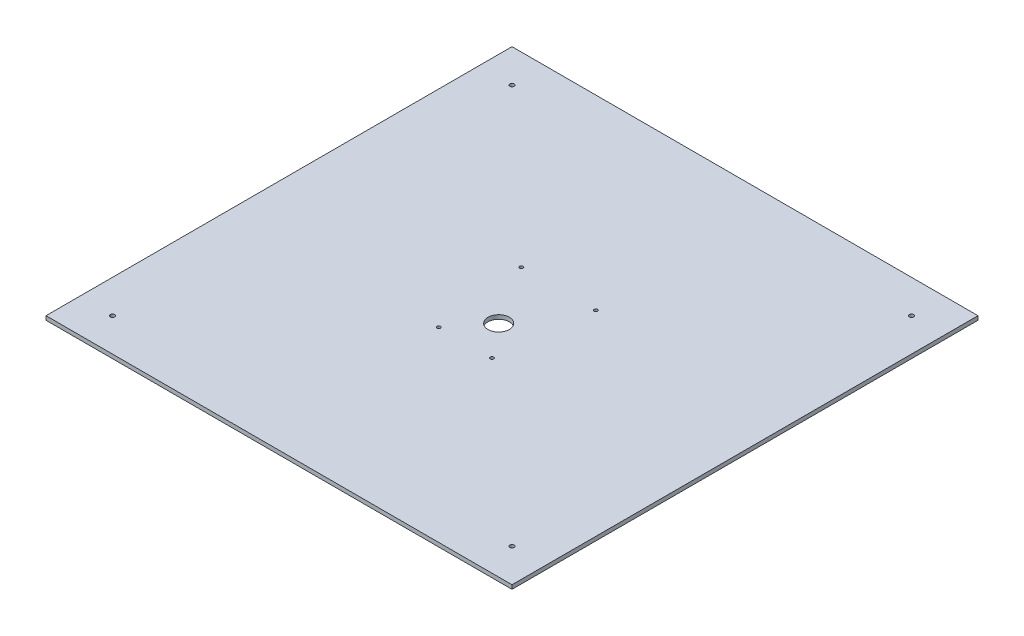
ISO-10303-21;
HEADER;
FILE_DESCRIPTION(('STEP AP214'),'2;1');
FILE_NAME('part.step','',(''),(''),'','','');
FILE_SCHEMA(('AUTOMOTIVE_DESIGN { 1 0 10303 214 1 1 1 1 }'));
ENDSEC;
DATA;
#1=APPLICATION_CONTEXT('core data for automotive mechanical design processes');
#2=APPLICATION_PROTOCOL_DEFINITION('international standard','automotive_design',2000,#1);
#3=PRODUCT_CONTEXT('',#1,'mechanical');
#4=PRODUCT('Part','Part','',(#3));
#5=PRODUCT_RELATED_PRODUCT_CATEGORY('part','',(#4));
#6=PRODUCT_DEFINITION_FORMATION('','',#4);
#7=PRODUCT_DEFINITION_CONTEXT('part definition',#1,'design');
#8=PRODUCT_DEFINITION('design','',#6,#7);
#9=PRODUCT_DEFINITION_SHAPE('','',#8);
#10=(LENGTH_UNIT() NAMED_UNIT(*) SI_UNIT(.MILLI.,.METRE.));
#11=(NAMED_UNIT(*) PLANE_ANGLE_UNIT() SI_UNIT($,.RADIAN.));
#12=(NAMED_UNIT(*) SI_UNIT($,.STERADIAN.) SOLID_ANGLE_UNIT());
#13=UNCERTAINTY_MEASURE_WITH_UNIT(LENGTH_MEASURE(1.E-05),#10,'distance_accuracy_value','');
#14=(GEOMETRIC_REPRESENTATION_CONTEXT(3) GLOBAL_UNCERTAINTY_ASSIGNED_CONTEXT((#13)) GLOBAL_UNIT_ASSIGNED_CONTEXT((#10,
#11,#12)) REPRESENTATION_CONTEXT('',''));
#15=CARTESIAN_POINT('',(0.,0.,0.));
#16=DIRECTION('',(0.,0.,1.));
#17=DIRECTION('',(1.,0.,0.));
#18=AXIS2_PLACEMENT_3D('',#15,#16,#17);
#19=CARTESIAN_POINT('',(0.,3.,0.));
#20=DIRECTION('',(0.,-1.,0.));
#21=DIRECTION('',(0.,0.,-1.));
#22=AXIS2_PLACEMENT_3D('',#19,#20,#21);
#23=PLANE('',#22);
#24=CARTESIAN_POINT('',(20.,3.,35.));
#25=DIRECTION('',(0.,1.,0.));
#26=DIRECTION('',(0.,0.,1.));
#27=AXIS2_PLACEMENT_3D('',#24,#25,#26);
#28=CIRCLE('',#27,1.3);
#29=CARTESIAN_POINT('',(20.,3.,36.3));
#30=VERTEX_POINT('',#29);
#31=EDGE_CURVE('E324',#30,#30,#28,.T.);
#32=ORIENTED_EDGE('',*,*,#31,.F.);
#33=EDGE_LOOP('',(#32));
#34=FACE_BOUND('',#33,.T.);
#35=CARTESIAN_POINT('',(-20.,3.,35.));
#36=DIRECTION('',(0.,1.,0.));
#37=DIRECTION('',(0.,0.,1.));
#38=AXIS2_PLACEMENT_3D('',#35,#36,#37);
#39=CIRCLE('',#38,1.3);
#40=CARTESIAN_POINT('',(-20.,3.,36.3));
#41=VERTEX_POINT('',#40);
#42=EDGE_CURVE('E327',#41,#41,#39,.T.);
#43=ORIENTED_EDGE('',*,*,#42,.F.);
#44=EDGE_LOOP('',(#43));
#45=FACE_BOUND('',#44,.T.);
#46=CARTESIAN_POINT('',(28.,3.,-35.));
#47=DIRECTION('',(0.,1.,0.));
#48=DIRECTION('',(0.,0.,1.));
#49=AXIS2_PLACEMENT_3D('',#46,#47,#48);
#50=CIRCLE('',#49,1.3);
#51=CARTESIAN_POINT('',(28.,3.,-33.7));
#52=VERTEX_POINT('',#51);
#53=EDGE_CURVE('E339',#52,#52,#50,.T.);
#54=ORIENTED_EDGE('',*,*,#53,.F.);
#55=EDGE_LOOP('',(#54));
#56=FACE_BOUND('',#55,.T.);
#57=CARTESIAN_POINT('',(-28.,3.,-35.));
#58=DIRECTION('',(0.,1.,0.));
#59=DIRECTION('',(0.,0.,1.));
#60=AXIS2_PLACEMENT_3D('',#57,#58,#59);
#61=CIRCLE('',#60,1.3);
#62=CARTESIAN_POINT('',(-28.,3.,-33.7));
#63=VERTEX_POINT('',#62);
#64=EDGE_CURVE('E346',#63,#63,#61,.T.);
#65=ORIENTED_EDGE('',*,*,#64,.F.);
#66=EDGE_LOOP('',(#65));
#67=FACE_BOUND('',#66,.T.);
#68=CARTESIAN_POINT('',(0.,3.,10.));
#69=DIRECTION('',(0.,1.,0.));
#70=DIRECTION('',(0.,0.,1.));
#71=AXIS2_PLACEMENT_3D('',#68,#69,#70);
#72=CIRCLE('',#71,8.);
#73=CARTESIAN_POINT('',(0.,3.,18.));
#74=VERTEX_POINT('',#73);
#75=EDGE_CURVE('E134',#74,#74,#72,.T.);
#76=ORIENTED_EDGE('',*,*,#75,.F.);
#77=EDGE_LOOP('',(#76));
#78=FACE_BOUND('',#77,.T.);
#79=DIRECTION('',(0.,0.,-1.));
#80=VECTOR('',#79,1.);
#81=CARTESIAN_POINT('',(175.000000049266,3.,175.000000049266));
#82=LINE('',#81,#80);
#83=CARTESIAN_POINT('',(175.000000049266,3.,175.000000049266));
#84=VERTEX_POINT('',#83);
#85=CARTESIAN_POINT('',(175.000000049266,3.,-175.000000049266));
#86=VERTEX_POINT('',#85);
#87=EDGE_CURVE('E90',#84,#86,#82,.T.);
#88=ORIENTED_EDGE('',*,*,#87,.T.);
#89=DIRECTION('',(-1.,0.,0.));
#90=VECTOR('',#89,1.);
#91=CARTESIAN_POINT('',(-175.000000049266,3.,-175.000000049266));
#92=LINE('',#91,#90);
#93=CARTESIAN_POINT('',(-175.000000049266,3.,-175.000000049266));
#94=VERTEX_POINT('',#93);
#95=EDGE_CURVE('E85',#86,#94,#92,.T.);
#96=ORIENTED_EDGE('',*,*,#95,.T.);
#97=DIRECTION('',(0.,0.,1.));
#98=VECTOR('',#97,1.);
#99=CARTESIAN_POINT('',(-175.000000049266,3.,175.000000049266));
#100=LINE('',#99,#98);
#101=CARTESIAN_POINT('',(-175.000000049266,3.,175.000000049266));
#102=VERTEX_POINT('',#101);
#103=EDGE_CURVE('E88',#94,#102,#100,.T.);
#104=ORIENTED_EDGE('',*,*,#103,.T.);
#105=DIRECTION('',(1.,0.,0.));
#106=VECTOR('',#105,1.);
#107=CARTESIAN_POINT('',(-175.000000049266,3.,175.000000049266));
#108=LINE('',#107,#106);
#109=EDGE_CURVE('E55',#102,#84,#108,.T.);
#110=ORIENTED_EDGE('',*,*,#109,.T.);
#111=EDGE_LOOP('',(#88,#96,#104,#110));
#112=FACE_BOUND('',#111,.T.);
#113=CARTESIAN_POINT('',(-150.,3.,-150.));
#114=DIRECTION('',(0.,1.,0.));
#115=DIRECTION('',(0.,0.,1.));
#116=AXIS2_PLACEMENT_3D('',#113,#114,#115);
#117=CIRCLE('',#116,1.59999999999999);
#118=CARTESIAN_POINT('',(-150.,3.,-148.4));
#119=VERTEX_POINT('',#118);
#120=EDGE_CURVE('E116',#119,#119,#117,.T.);
#121=ORIENTED_EDGE('',*,*,#120,.F.);
#122=EDGE_LOOP('',(#121));
#123=FACE_BOUND('',#122,.T.);
#124=CARTESIAN_POINT('',(-150.,3.,150.));
#125=DIRECTION('',(0.,1.,0.));
#126=DIRECTION('',(0.,0.,1.));
#127=AXIS2_PLACEMENT_3D('',#124,#125,#126);
#128=CIRCLE('',#127,1.59999999999999);
#129=CARTESIAN_POINT('',(-150.,3.,151.6));
#130=VERTEX_POINT('',#129);
#131=EDGE_CURVE('E126',#130,#130,#128,.T.);
#132=ORIENTED_EDGE('',*,*,#131,.F.);
#133=EDGE_LOOP('',(#132));
#134=FACE_BOUND('',#133,.T.);
#135=CARTESIAN_POINT('',(150.,3.,150.));
#136=DIRECTION('',(0.,1.,0.));
#137=DIRECTION('',(0.,0.,1.));
#138=AXIS2_PLACEMENT_3D('',#135,#136,#137);
#139=CIRCLE('',#138,1.59999999999999);
#140=CARTESIAN_POINT('',(150.,3.,151.6));
#141=VERTEX_POINT('',#140);
#142=EDGE_CURVE('E151',#141,#141,#139,.T.);
#143=ORIENTED_EDGE('',*,*,#142,.F.);
#144=EDGE_LOOP('',(#143));
#145=FACE_BOUND('',#144,.T.);
#146=CARTESIAN_POINT('',(150.,3.,-150.));
#147=DIRECTION('',(0.,1.,0.));
#148=DIRECTION('',(0.,0.,1.));
#149=AXIS2_PLACEMENT_3D('',#146,#147,#148);
#150=CIRCLE('',#149,1.59999999999999);
#151=CARTESIAN_POINT('',(150.,3.,-148.4));
#152=VERTEX_POINT('',#151);
#153=EDGE_CURVE('E142',#152,#152,#150,.T.);
#154=ORIENTED_EDGE('',*,*,#153,.F.);
#155=EDGE_LOOP('',(#154));
#156=FACE_BOUND('',#155,.T.);
#157=ADVANCED_FACE('F38',(#34,#45,#56,#67,#78,#112,#123,#134,#145,#156),#23,.F.);
#158=CARTESIAN_POINT('',(0.,0.,0.));
#159=DIRECTION('',(0.,-1.,0.));
#160=DIRECTION('',(0.,0.,-1.));
#161=AXIS2_PLACEMENT_3D('',#158,#159,#160);
#162=PLANE('',#161);
#163=CARTESIAN_POINT('',(20.,0.,35.));
#164=DIRECTION('',(0.,1.,0.));
#165=DIRECTION('',(0.,0.,1.));
#166=AXIS2_PLACEMENT_3D('',#163,#164,#165);
#167=CIRCLE('',#166,1.3);
#168=CARTESIAN_POINT('',(20.,0.,36.3));
#169=VERTEX_POINT('',#168);
#170=EDGE_CURVE('E322',#169,#169,#167,.T.);
#171=ORIENTED_EDGE('',*,*,#170,.T.);
#172=EDGE_LOOP('',(#171));
#173=FACE_BOUND('',#172,.T.);
#174=CARTESIAN_POINT('',(-20.,0.,35.));
#175=DIRECTION('',(0.,1.,0.));
#176=DIRECTION('',(0.,0.,1.));
#177=AXIS2_PLACEMENT_3D('',#174,#175,#176);
#178=CIRCLE('',#177,1.3);
#179=CARTESIAN_POINT('',(-20.,0.,36.3));
#180=VERTEX_POINT('',#179);
#181=EDGE_CURVE('E337',#180,#180,#178,.T.);
#182=ORIENTED_EDGE('',*,*,#181,.T.);
#183=EDGE_LOOP('',(#182));
#184=FACE_BOUND('',#183,.T.);
#185=CARTESIAN_POINT('',(28.,0.,-35.));
#186=DIRECTION('',(0.,1.,0.));
#187=DIRECTION('',(0.,0.,1.));
#188=AXIS2_PLACEMENT_3D('',#185,#186,#187);
#189=CIRCLE('',#188,1.3);
#190=CARTESIAN_POINT('',(28.,0.,-33.7));
#191=VERTEX_POINT('',#190);
#192=EDGE_CURVE('E344',#191,#191,#189,.T.);
#193=ORIENTED_EDGE('',*,*,#192,.T.);
#194=EDGE_LOOP('',(#193));
#195=FACE_BOUND('',#194,.T.);
#196=CARTESIAN_POINT('',(-28.,0.,-35.));
#197=DIRECTION('',(0.,1.,0.));
#198=DIRECTION('',(0.,0.,1.));
#199=AXIS2_PLACEMENT_3D('',#196,#197,#198);
#200=CIRCLE('',#199,1.3);
#201=CARTESIAN_POINT('',(-28.,0.,-33.7));
#202=VERTEX_POINT('',#201);
#203=EDGE_CURVE('E140',#202,#202,#200,.T.);
#204=ORIENTED_EDGE('',*,*,#203,.T.);
#205=EDGE_LOOP('',(#204));
#206=FACE_BOUND('',#205,.T.);
#207=CARTESIAN_POINT('',(0.,0.,10.));
#208=DIRECTION('',(0.,1.,0.));
#209=DIRECTION('',(0.,0.,1.));
#210=AXIS2_PLACEMENT_3D('',#207,#208,#209);
#211=CIRCLE('',#210,8.);
#212=CARTESIAN_POINT('',(0.,0.,18.));
#213=VERTEX_POINT('',#212);
#214=EDGE_CURVE('E139',#213,#213,#211,.T.);
#215=ORIENTED_EDGE('',*,*,#214,.T.);
#216=EDGE_LOOP('',(#215));
#217=FACE_BOUND('',#216,.T.);
#218=CARTESIAN_POINT('',(150.,0.,150.));
#219=DIRECTION('',(0.,1.,0.));
#220=DIRECTION('',(0.,0.,1.));
#221=AXIS2_PLACEMENT_3D('',#218,#219,#220);
#222=CIRCLE('',#221,1.59999999999999);
#223=CARTESIAN_POINT('',(150.,0.,151.6));
#224=VERTEX_POINT('',#223);
#225=EDGE_CURVE('E147',#224,#224,#222,.T.);
#226=ORIENTED_EDGE('',*,*,#225,.T.);
#227=EDGE_LOOP('',(#226));
#228=FACE_BOUND('',#227,.T.);
#229=CARTESIAN_POINT('',(-150.,0.,-150.));
#230=DIRECTION('',(0.,1.,0.));
#231=DIRECTION('',(0.,0.,1.));
#232=AXIS2_PLACEMENT_3D('',#229,#230,#231);
#233=CIRCLE('',#232,1.59999999999999);
#234=CARTESIAN_POINT('',(-150.,0.,-148.4));
#235=VERTEX_POINT('',#234);
#236=EDGE_CURVE('E123',#235,#235,#233,.T.);
#237=ORIENTED_EDGE('',*,*,#236,.T.);
#238=EDGE_LOOP('',(#237));
#239=FACE_BOUND('',#238,.T.);
#240=DIRECTION('',(0.,0.,-1.));
#241=VECTOR('',#240,1.);
#242=CARTESIAN_POINT('',(175.000000049266,0.,175.000000049266));
#243=LINE('',#242,#241);
#244=CARTESIAN_POINT('',(175.000000049266,0.,175.000000049266));
#245=VERTEX_POINT('',#244);
#246=CARTESIAN_POINT('',(175.000000049266,0.,-175.000000049266));
#247=VERTEX_POINT('',#246);
#248=EDGE_CURVE('E122',#245,#247,#243,.T.);
#249=ORIENTED_EDGE('',*,*,#248,.F.);
#250=DIRECTION('',(1.,0.,0.));
#251=VECTOR('',#250,1.);
#252=CARTESIAN_POINT('',(-175.000000049266,0.,175.000000049266));
#253=LINE('',#252,#251);
#254=CARTESIAN_POINT('',(-175.000000049266,0.,175.000000049266));
#255=VERTEX_POINT('',#254);
#256=EDGE_CURVE('E78',#255,#245,#253,.T.);
#257=ORIENTED_EDGE('',*,*,#256,.F.);
#258=DIRECTION('',(0.,0.,1.));
#259=VECTOR('',#258,1.);
#260=CARTESIAN_POINT('',(-175.000000049266,0.,175.000000049266));
#261=LINE('',#260,#259);
#262=CARTESIAN_POINT('',(-175.000000049266,0.,-175.000000049266));
#263=VERTEX_POINT('',#262);
#264=EDGE_CURVE('E72',#263,#255,#261,.T.);
#265=ORIENTED_EDGE('',*,*,#264,.F.);
#266=DIRECTION('',(-1.,0.,0.));
#267=VECTOR('',#266,1.);
#268=CARTESIAN_POINT('',(-175.000000049266,0.,-175.000000049266));
#269=LINE('',#268,#267);
#270=EDGE_CURVE('E95',#247,#263,#269,.T.);
#271=ORIENTED_EDGE('',*,*,#270,.F.);
#272=EDGE_LOOP('',(#249,#257,#265,#271));
#273=FACE_BOUND('',#272,.T.);
#274=CARTESIAN_POINT('',(-150.,0.,150.));
#275=DIRECTION('',(0.,1.,0.));
#276=DIRECTION('',(0.,0.,1.));
#277=AXIS2_PLACEMENT_3D('',#274,#275,#276);
#278=CIRCLE('',#277,1.59999999999999);
#279=CARTESIAN_POINT('',(-150.,0.,151.6));
#280=VERTEX_POINT('',#279);
#281=EDGE_CURVE('E124',#280,#280,#278,.T.);
#282=ORIENTED_EDGE('',*,*,#281,.T.);
#283=EDGE_LOOP('',(#282));
#284=FACE_BOUND('',#283,.T.);
#285=CARTESIAN_POINT('',(150.,0.,-150.));
#286=DIRECTION('',(0.,1.,0.));
#287=DIRECTION('',(0.,0.,1.));
#288=AXIS2_PLACEMENT_3D('',#285,#286,#287);
#289=CIRCLE('',#288,1.59999999999999);
#290=CARTESIAN_POINT('',(150.,0.,-148.4));
#291=VERTEX_POINT('',#290);
#292=EDGE_CURVE('E148',#291,#291,#289,.T.);
#293=ORIENTED_EDGE('',*,*,#292,.T.);
#294=EDGE_LOOP('',(#293));
#295=FACE_BOUND('',#294,.T.);
#296=ADVANCED_FACE('F165',(#173,#184,#195,#206,#217,#228,#239,#273,#284,#295),#162,.T.);
#297=CARTESIAN_POINT('',(175.000000049266,3.,175.000000049266));
#298=DIRECTION('',(-1.,0.,0.));
#299=DIRECTION('',(0.,0.,1.));
#300=AXIS2_PLACEMENT_3D('',#297,#298,#299);
#301=PLANE('',#300);
#302=ORIENTED_EDGE('',*,*,#248,.T.);
#303=DIRECTION('',(0.,-1.,0.));
#304=VECTOR('',#303,1.);
#305=CARTESIAN_POINT('',(175.000000049266,3.,-175.000000049266));
#306=LINE('',#305,#304);
#307=EDGE_CURVE('E12',#86,#247,#306,.T.);
#308=ORIENTED_EDGE('',*,*,#307,.F.);
#309=ORIENTED_EDGE('',*,*,#87,.F.);
#310=DIRECTION('',(0.,-1.,0.));
#311=VECTOR('',#310,1.);
#312=CARTESIAN_POINT('',(175.000000049266,3.,175.000000049266));
#313=LINE('',#312,#311);
#314=EDGE_CURVE('E101',#84,#245,#313,.T.);
#315=ORIENTED_EDGE('',*,*,#314,.T.);
#316=EDGE_LOOP('',(#302,#308,#309,#315));
#317=FACE_BOUND('',#316,.T.);
#318=ADVANCED_FACE('F40',(#317),#301,.F.);
#319=CARTESIAN_POINT('',(-175.000000049266,3.,-175.000000049266));
#320=DIRECTION('',(0.,0.,1.));
#321=DIRECTION('',(1.,0.,0.));
#322=AXIS2_PLACEMENT_3D('',#319,#320,#321);
#323=PLANE('',#322);
#324=ORIENTED_EDGE('',*,*,#270,.T.);
#325=DIRECTION('',(0.,-1.,0.));
#326=VECTOR('',#325,1.);
#327=CARTESIAN_POINT('',(-175.000000049266,3.,-175.000000049266));
#328=LINE('',#327,#326);
#329=EDGE_CURVE('E47',#94,#263,#328,.T.);
#330=ORIENTED_EDGE('',*,*,#329,.F.);
#331=ORIENTED_EDGE('',*,*,#95,.F.);
#332=ORIENTED_EDGE('',*,*,#307,.T.);
#333=EDGE_LOOP('',(#324,#330,#331,#332));
#334=FACE_BOUND('',#333,.T.);
#335=ADVANCED_FACE('F94',(#334),#323,.F.);
#336=CARTESIAN_POINT('',(-175.000000049266,3.,175.000000049266));
#337=DIRECTION('',(1.,0.,0.));
#338=DIRECTION('',(0.,0.,-1.));
#339=AXIS2_PLACEMENT_3D('',#336,#337,#338);
#340=PLANE('',#339);
#341=ORIENTED_EDGE('',*,*,#264,.T.);
#342=DIRECTION('',(0.,-1.,0.));
#343=VECTOR('',#342,1.);
#344=CARTESIAN_POINT('',(-175.000000049266,3.,175.000000049266));
#345=LINE('',#344,#343);
#346=EDGE_CURVE('E96',#102,#255,#345,.T.);
#347=ORIENTED_EDGE('',*,*,#346,.F.);
#348=ORIENTED_EDGE('',*,*,#103,.F.);
#349=ORIENTED_EDGE('',*,*,#329,.T.);
#350=EDGE_LOOP('',(#341,#347,#348,#349));
#351=FACE_BOUND('',#350,.T.);
#352=ADVANCED_FACE('F97',(#351),#340,.F.);
#353=CARTESIAN_POINT('',(-175.000000049266,3.,175.000000049266));
#354=DIRECTION('',(0.,0.,-1.));
#355=DIRECTION('',(-1.,0.,0.));
#356=AXIS2_PLACEMENT_3D('',#353,#354,#355);
#357=PLANE('',#356);
#358=ORIENTED_EDGE('',*,*,#256,.T.);
#359=ORIENTED_EDGE('',*,*,#314,.F.);
#360=ORIENTED_EDGE('',*,*,#109,.F.);
#361=ORIENTED_EDGE('',*,*,#346,.T.);
#362=EDGE_LOOP('',(#358,#359,#360,#361));
#363=FACE_BOUND('',#362,.T.);
#364=ADVANCED_FACE('F180',(#363),#357,.F.);
#365=CARTESIAN_POINT('',(-150.,3.,-150.));
#366=DIRECTION('',(0.,-1.,0.));
#367=DIRECTION('',(0.,0.,-1.));
#368=AXIS2_PLACEMENT_3D('',#365,#366,#367);
#369=CYLINDRICAL_SURFACE('',#368,1.59999999999999);
#370=ORIENTED_EDGE('',*,*,#120,.T.);
#371=EDGE_LOOP('',(#370));
#372=FACE_BOUND('',#371,.T.);
#373=ORIENTED_EDGE('',*,*,#236,.F.);
#374=EDGE_LOOP('',(#373));
#375=FACE_BOUND('',#374,.T.);
#376=ADVANCED_FACE('F171',(#372,#375),#369,.F.);
#377=CARTESIAN_POINT('',(-150.,3.,150.));
#378=DIRECTION('',(0.,-1.,0.));
#379=DIRECTION('',(0.,0.,-1.));
#380=AXIS2_PLACEMENT_3D('',#377,#378,#379);
#381=CYLINDRICAL_SURFACE('',#380,1.59999999999999);
#382=ORIENTED_EDGE('',*,*,#131,.T.);
#383=EDGE_LOOP('',(#382));
#384=FACE_BOUND('',#383,.T.);
#385=ORIENTED_EDGE('',*,*,#281,.F.);
#386=EDGE_LOOP('',(#385));
#387=FACE_BOUND('',#386,.T.);
#388=ADVANCED_FACE('F168',(#384,#387),#381,.F.);
#389=CARTESIAN_POINT('',(150.,3.,150.));
#390=DIRECTION('',(0.,-1.,0.));
#391=DIRECTION('',(0.,0.,-1.));
#392=AXIS2_PLACEMENT_3D('',#389,#390,#391);
#393=CYLINDRICAL_SURFACE('',#392,1.59999999999999);
#394=ORIENTED_EDGE('',*,*,#142,.T.);
#395=EDGE_LOOP('',(#394));
#396=FACE_BOUND('',#395,.T.);
#397=ORIENTED_EDGE('',*,*,#225,.F.);
#398=EDGE_LOOP('',(#397));
#399=FACE_BOUND('',#398,.T.);
#400=ADVANCED_FACE('F170',(#396,#399),#393,.F.);
#401=CARTESIAN_POINT('',(150.,3.,-150.));
#402=DIRECTION('',(0.,-1.,0.));
#403=DIRECTION('',(0.,0.,-1.));
#404=AXIS2_PLACEMENT_3D('',#401,#402,#403);
#405=CYLINDRICAL_SURFACE('',#404,1.59999999999999);
#406=ORIENTED_EDGE('',*,*,#153,.T.);
#407=EDGE_LOOP('',(#406));
#408=FACE_BOUND('',#407,.T.);
#409=ORIENTED_EDGE('',*,*,#292,.F.);
#410=EDGE_LOOP('',(#409));
#411=FACE_BOUND('',#410,.T.);
#412=ADVANCED_FACE('F177',(#408,#411),#405,.F.);
#413=CARTESIAN_POINT('',(0.,0.,10.));
#414=DIRECTION('',(0.,1.,0.));
#415=DIRECTION('',(0.,0.,1.));
#416=AXIS2_PLACEMENT_3D('',#413,#414,#415);
#417=CYLINDRICAL_SURFACE('',#416,8.);
#418=ORIENTED_EDGE('',*,*,#214,.F.);
#419=EDGE_LOOP('',(#418));
#420=FACE_BOUND('',#419,.T.);
#421=ORIENTED_EDGE('',*,*,#75,.T.);
#422=EDGE_LOOP('',(#421));
#423=FACE_BOUND('',#422,.T.);
#424=ADVANCED_FACE('F224',(#420,#423),#417,.F.);
#425=CARTESIAN_POINT('',(-28.,0.,-35.));
#426=DIRECTION('',(0.,1.,0.));
#427=DIRECTION('',(0.,0.,1.));
#428=AXIS2_PLACEMENT_3D('',#425,#426,#427);
#429=CYLINDRICAL_SURFACE('',#428,1.3);
#430=ORIENTED_EDGE('',*,*,#203,.F.);
#431=EDGE_LOOP('',(#430));
#432=FACE_BOUND('',#431,.T.);
#433=ORIENTED_EDGE('',*,*,#64,.T.);
#434=EDGE_LOOP('',(#433));
#435=FACE_BOUND('',#434,.T.);
#436=ADVANCED_FACE('F229',(#432,#435),#429,.F.);
#437=CARTESIAN_POINT('',(28.,0.,-35.));
#438=DIRECTION('',(0.,1.,0.));
#439=DIRECTION('',(0.,0.,1.));
#440=AXIS2_PLACEMENT_3D('',#437,#438,#439);
#441=CYLINDRICAL_SURFACE('',#440,1.3);
#442=ORIENTED_EDGE('',*,*,#192,.F.);
#443=EDGE_LOOP('',(#442));
#444=FACE_BOUND('',#443,.T.);
#445=ORIENTED_EDGE('',*,*,#53,.T.);
#446=EDGE_LOOP('',(#445));
#447=FACE_BOUND('',#446,.T.);
#448=ADVANCED_FACE('F241',(#444,#447),#441,.F.);
#449=CARTESIAN_POINT('',(-20.,0.,35.));
#450=DIRECTION('',(0.,1.,0.));
#451=DIRECTION('',(0.,0.,1.));
#452=AXIS2_PLACEMENT_3D('',#449,#450,#451);
#453=CYLINDRICAL_SURFACE('',#452,1.3);
#454=ORIENTED_EDGE('',*,*,#181,.F.);
#455=EDGE_LOOP('',(#454));
#456=FACE_BOUND('',#455,.T.);
#457=ORIENTED_EDGE('',*,*,#42,.T.);
#458=EDGE_LOOP('',(#457));
#459=FACE_BOUND('',#458,.T.);
#460=ADVANCED_FACE('F251',(#456,#459),#453,.F.);
#461=CARTESIAN_POINT('',(20.,0.,35.));
#462=DIRECTION('',(0.,1.,0.));
#463=DIRECTION('',(0.,0.,1.));
#464=AXIS2_PLACEMENT_3D('',#461,#462,#463);
#465=CYLINDRICAL_SURFACE('',#464,1.3);
#466=ORIENTED_EDGE('',*,*,#170,.F.);
#467=EDGE_LOOP('',(#466));
#468=FACE_BOUND('',#467,.T.);
#469=ORIENTED_EDGE('',*,*,#31,.T.);
#470=EDGE_LOOP('',(#469));
#471=FACE_BOUND('',#470,.T.);
#472=ADVANCED_FACE('F261',(#468,#471),#465,.F.);
#473=CLOSED_SHELL('',(#157,#296,#318,#335,#352,#364,#376,#388,#400,#412,#424,#436,#448,#460,#472));
#474=MANIFOLD_SOLID_BREP('B2',#473);
#475=ADVANCED_BREP_SHAPE_REPRESENTATION('',(#18,#474),#14);
#476=SHAPE_DEFINITION_REPRESENTATION(#9,#475);
ENDSEC;
END-ISO-10303-21;
